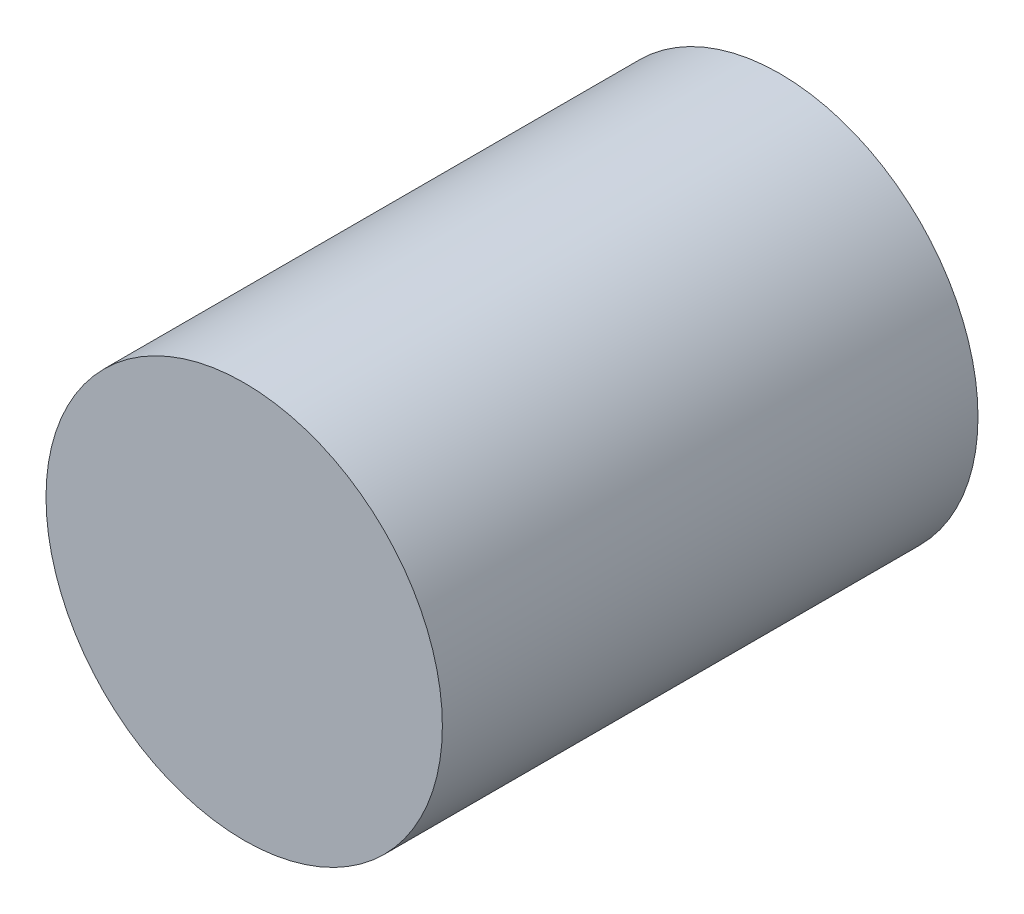
ISO-10303-21;
HEADER;
FILE_DESCRIPTION(('STEP AP214'),'2;1');
FILE_NAME('part.step','',(''),(''),'','','');
FILE_SCHEMA(('AUTOMOTIVE_DESIGN { 1 0 10303 214 1 1 1 1 }'));
ENDSEC;
DATA;
#1=APPLICATION_CONTEXT('core data for automotive mechanical design processes');
#2=APPLICATION_PROTOCOL_DEFINITION('international standard','automotive_design',2000,#1);
#3=PRODUCT_CONTEXT('',#1,'mechanical');
#4=PRODUCT('Part','Part','',(#3));
#5=PRODUCT_RELATED_PRODUCT_CATEGORY('part','',(#4));
#6=PRODUCT_DEFINITION_FORMATION('','',#4);
#7=PRODUCT_DEFINITION_CONTEXT('part definition',#1,'design');
#8=PRODUCT_DEFINITION('design','',#6,#7);
#9=PRODUCT_DEFINITION_SHAPE('','',#8);
#10=(LENGTH_UNIT() NAMED_UNIT(*) SI_UNIT(.MILLI.,.METRE.));
#11=(NAMED_UNIT(*) PLANE_ANGLE_UNIT() SI_UNIT($,.RADIAN.));
#12=(NAMED_UNIT(*) SI_UNIT($,.STERADIAN.) SOLID_ANGLE_UNIT());
#13=UNCERTAINTY_MEASURE_WITH_UNIT(LENGTH_MEASURE(1.E-05),#10,'distance_accuracy_value','');
#14=(GEOMETRIC_REPRESENTATION_CONTEXT(3) GLOBAL_UNCERTAINTY_ASSIGNED_CONTEXT((#13)) GLOBAL_UNIT_ASSIGNED_CONTEXT((#10,
#11,#12)) REPRESENTATION_CONTEXT('',''));
#15=CARTESIAN_POINT('',(0.,0.,0.));
#16=DIRECTION('',(0.,0.,1.));
#17=DIRECTION('',(1.,0.,0.));
#18=AXIS2_PLACEMENT_3D('',#15,#16,#17);
#19=CARTESIAN_POINT('',(0.,0.,12.7));
#20=DIRECTION('',(0.,0.,-1.));
#21=DIRECTION('',(-1.,0.,0.));
#22=AXIS2_PLACEMENT_3D('',#19,#20,#21);
#23=CYLINDRICAL_SURFACE('',#22,4.699);
#24=CARTESIAN_POINT('',(0.,0.,12.7));
#25=DIRECTION('',(0.,0.,1.));
#26=DIRECTION('',(1.,0.,0.));
#27=AXIS2_PLACEMENT_3D('',#24,#25,#26);
#28=CIRCLE('',#27,4.699);
#29=CARTESIAN_POINT('',(4.699,0.,12.7));
#30=VERTEX_POINT('',#29);
#31=EDGE_CURVE('E10',#30,#30,#28,.T.);
#32=ORIENTED_EDGE('',*,*,#31,.F.);
#33=EDGE_LOOP('',(#32));
#34=FACE_BOUND('',#33,.T.);
#35=CARTESIAN_POINT('',(0.,0.,0.));
#36=DIRECTION('',(0.,0.,1.));
#37=DIRECTION('',(1.,0.,0.));
#38=AXIS2_PLACEMENT_3D('',#35,#36,#37);
#39=CIRCLE('',#38,4.699);
#40=CARTESIAN_POINT('',(4.699,0.,0.));
#41=VERTEX_POINT('',#40);
#42=EDGE_CURVE('E42',#41,#41,#39,.T.);
#43=ORIENTED_EDGE('',*,*,#42,.T.);
#44=EDGE_LOOP('',(#43));
#45=FACE_BOUND('',#44,.T.);
#46=ADVANCED_FACE('F39',(#34,#45),#23,.T.);
#47=CARTESIAN_POINT('',(0.,0.,12.7));
#48=DIRECTION('',(0.,0.,1.));
#49=DIRECTION('',(1.,0.,0.));
#50=AXIS2_PLACEMENT_3D('',#47,#48,#49);
#51=PLANE('',#50);
#52=ORIENTED_EDGE('',*,*,#31,.T.);
#53=EDGE_LOOP('',(#52));
#54=FACE_BOUND('',#53,.T.);
#55=ADVANCED_FACE('F56',(#54),#51,.T.);
#56=CARTESIAN_POINT('',(0.,0.,0.));
#57=DIRECTION('',(0.,0.,1.));
#58=DIRECTION('',(1.,0.,0.));
#59=AXIS2_PLACEMENT_3D('',#56,#57,#58);
#60=PLANE('',#59);
#61=ORIENTED_EDGE('',*,*,#42,.F.);
#62=EDGE_LOOP('',(#61));
#63=FACE_BOUND('',#62,.T.);
#64=ADVANCED_FACE('F54',(#63),#60,.F.);
#65=CLOSED_SHELL('',(#46,#55,#64));
#66=MANIFOLD_SOLID_BREP('B2',#65);
#67=ADVANCED_BREP_SHAPE_REPRESENTATION('',(#18,#66),#14);
#68=SHAPE_DEFINITION_REPRESENTATION(#9,#67);
ENDSEC;
END-ISO-10303-21;
